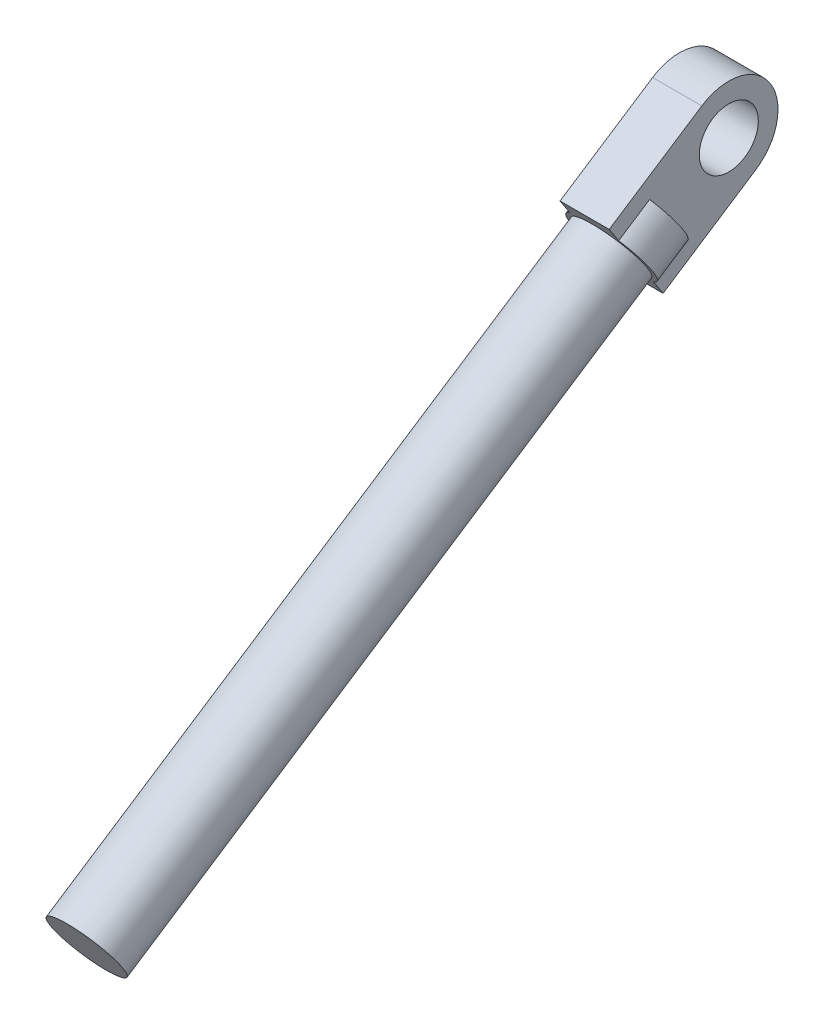
ISO-10303-21;
HEADER;
FILE_DESCRIPTION(('STEP AP214'),'2;1');
FILE_NAME('part.step','',(''),(''),'','','');
FILE_SCHEMA(('AUTOMOTIVE_DESIGN { 1 0 10303 214 1 1 1 1 }'));
ENDSEC;
DATA;
#1=APPLICATION_CONTEXT('core data for automotive mechanical design processes');
#2=APPLICATION_PROTOCOL_DEFINITION('international standard','automotive_design',2000,#1);
#3=PRODUCT_CONTEXT('',#1,'mechanical');
#4=PRODUCT('Part','Part','',(#3));
#5=PRODUCT_RELATED_PRODUCT_CATEGORY('part','',(#4));
#6=PRODUCT_DEFINITION_FORMATION('','',#4);
#7=PRODUCT_DEFINITION_CONTEXT('part definition',#1,'design');
#8=PRODUCT_DEFINITION('design','',#6,#7);
#9=PRODUCT_DEFINITION_SHAPE('','',#8);
#10=(LENGTH_UNIT() NAMED_UNIT(*) SI_UNIT(.MILLI.,.METRE.));
#11=(NAMED_UNIT(*) PLANE_ANGLE_UNIT() SI_UNIT($,.RADIAN.));
#12=(NAMED_UNIT(*) SI_UNIT($,.STERADIAN.) SOLID_ANGLE_UNIT());
#13=UNCERTAINTY_MEASURE_WITH_UNIT(LENGTH_MEASURE(1.E-05),#10,'distance_accuracy_value','');
#14=(GEOMETRIC_REPRESENTATION_CONTEXT(3) GLOBAL_UNCERTAINTY_ASSIGNED_CONTEXT((#13)) GLOBAL_UNIT_ASSIGNED_CONTEXT((#10,
#11,#12)) REPRESENTATION_CONTEXT('',''));
#15=CARTESIAN_POINT('',(0.,0.,0.));
#16=DIRECTION('',(0.,0.,1.));
#17=DIRECTION('',(1.,0.,0.));
#18=AXIS2_PLACEMENT_3D('',#15,#16,#17);
#19=CARTESIAN_POINT('',(2000.00000004822,5467.96135295154,-4305.75126019251));
#20=DIRECTION('',(0.,-0.547699180385105,0.836675329984985));
#21=DIRECTION('',(-1.,0.,0.));
#22=AXIS2_PLACEMENT_3D('',#19,#20,#21);
#23=PLANE('',#22);
#24=DIRECTION('',(0.,-0.836675329984985,-0.547699180385105));
#25=VECTOR('',#24,1.);
#26=CARTESIAN_POINT('',(2050.00000004817,5467.96135295154,-4305.75126019251));
#27=LINE('',#26,#25);
#28=CARTESIAN_POINT('',(2050.00000004817,5413.79157733861,-4341.21154047277));
#29=VERTEX_POINT('',#28);
#30=CARTESIAN_POINT('',(2050.00000004817,5522.13112856446,-4270.29097991226));
#31=VERTEX_POINT('',#30);
#32=EDGE_CURVE('E74',#29,#31,#27,.F.);
#33=ORIENTED_EDGE('',*,*,#32,.T.);
#34=CARTESIAN_POINT('',(2000.00000004822,5467.96135295154,-4305.75126019251));
#35=DIRECTION('',(0.,-0.547699180385105,0.836675329984985));
#36=DIRECTION('',(-1.,0.,0.));
#37=AXIS2_PLACEMENT_3D('',#34,#35,#36);
#38=CIRCLE('',#37,81.8033988750113);
#39=EDGE_CURVE('E19',#29,#31,#38,.T.);
#40=ORIENTED_EDGE('',*,*,#39,.F.);
#41=EDGE_LOOP('',(#33,#40));
#42=FACE_BOUND('',#41,.T.);
#43=ADVANCED_FACE('F16',(#42),#23,.F.);
#44=CARTESIAN_POINT('',(1950.00000004817,5550.11623000931,-4431.25255969027));
#45=DIRECTION('',(-1.,0.,0.));
#46=DIRECTION('',(0.,0.547699180385105,-0.836675329984985));
#47=AXIS2_PLACEMENT_3D('',#44,#45,#46);
#48=CYLINDRICAL_SURFACE('',#47,60.0000000000005);
#49=CARTESIAN_POINT('',(1950.00000004817,5550.11623000931,-4431.25255969027));
#50=DIRECTION('',(-1.,0.,0.));
#51=DIRECTION('',(0.,0.547699180385105,-0.836675329984985));
#52=AXIS2_PLACEMENT_3D('',#49,#50,#51);
#53=CIRCLE('',#52,60.0000000000005);
#54=CARTESIAN_POINT('',(1950.00000004817,5582.97818083242,-4481.45307948937));
#55=VERTEX_POINT('',#54);
#56=EDGE_CURVE('E118',#55,#55,#53,.F.);
#57=ORIENTED_EDGE('',*,*,#56,.F.);
#58=EDGE_LOOP('',(#57));
#59=FACE_BOUND('',#58,.T.);
#60=CARTESIAN_POINT('',(2050.00000004817,5550.11623000931,-4431.25255969027));
#61=DIRECTION('',(-1.,0.,0.));
#62=DIRECTION('',(0.,0.547699180385105,-0.836675329984985));
#63=AXIS2_PLACEMENT_3D('',#60,#61,#62);
#64=CIRCLE('',#63,60.0000000000005);
#65=CARTESIAN_POINT('',(2050.00000004817,5582.97818083242,-4481.45307948937));
#66=VERTEX_POINT('',#65);
#67=EDGE_CURVE('E77',#66,#66,#64,.F.);
#68=ORIENTED_EDGE('',*,*,#67,.T.);
#69=EDGE_LOOP('',(#68));
#70=FACE_BOUND('',#69,.T.);
#71=ADVANCED_FACE('F201',(#59,#70),#48,.F.);
#72=CARTESIAN_POINT('',(2050.00000004817,5550.11623000931,-4431.25255969027));
#73=DIRECTION('',(-1.,0.,0.));
#74=DIRECTION('',(0.,0.547699180385105,-0.836675329984985));
#75=AXIS2_PLACEMENT_3D('',#72,#73,#74);
#76=CYLINDRICAL_SURFACE('',#75,99.9999999999996);
#77=DIRECTION('',(1.,0.,0.));
#78=VECTOR('',#77,1.);
#79=CARTESIAN_POINT('',(2050.00000004817,5466.44869701081,-4486.02247772878));
#80=LINE('',#79,#78);
#81=CARTESIAN_POINT('',(1950.00000004817,5466.44869701081,-4486.02247772878));
#82=VERTEX_POINT('',#81);
#83=CARTESIAN_POINT('',(2050.00000004817,5466.44869701081,-4486.02247772878));
#84=VERTEX_POINT('',#83);
#85=EDGE_CURVE('E78',#82,#84,#80,.T.);
#86=ORIENTED_EDGE('',*,*,#85,.F.);
#87=CARTESIAN_POINT('',(1950.00000004817,5550.11623000931,-4431.25255969027));
#88=DIRECTION('',(-1.,0.,0.));
#89=DIRECTION('',(0.,0.547699180385105,-0.836675329984985));
#90=AXIS2_PLACEMENT_3D('',#87,#88,#89);
#91=CIRCLE('',#90,99.9999999999996);
#92=CARTESIAN_POINT('',(1950.00000004817,5633.78376300781,-4376.48264165176));
#93=VERTEX_POINT('',#92);
#94=EDGE_CURVE('E113',#93,#82,#91,.T.);
#95=ORIENTED_EDGE('',*,*,#94,.F.);
#96=DIRECTION('',(1.,0.,0.));
#97=VECTOR('',#96,1.);
#98=CARTESIAN_POINT('',(2050.00000004817,5633.78376300781,-4376.48264165176));
#99=LINE('',#98,#97);
#100=CARTESIAN_POINT('',(2050.00000004817,5633.78376300781,-4376.48264165176));
#101=VERTEX_POINT('',#100);
#102=EDGE_CURVE('E96',#101,#93,#99,.F.);
#103=ORIENTED_EDGE('',*,*,#102,.F.);
#104=CARTESIAN_POINT('',(2050.00000004817,5550.11623000931,-4431.25255969027));
#105=DIRECTION('',(-1.,0.,0.));
#106=DIRECTION('',(0.,0.547699180385105,-0.836675329984985));
#107=AXIS2_PLACEMENT_3D('',#104,#105,#106);
#108=CIRCLE('',#107,99.9999999999996);
#109=EDGE_CURVE('E122',#101,#84,#108,.T.);
#110=ORIENTED_EDGE('',*,*,#109,.T.);
#111=EDGE_LOOP('',(#86,#95,#103,#110));
#112=FACE_BOUND('',#111,.T.);
#113=ADVANCED_FACE('F199',(#112),#76,.T.);
#114=CARTESIAN_POINT('',(2000.00000004822,5467.96135295154,-4305.75126019251));
#115=DIRECTION('',(0.,-0.547699180385105,0.836675329984985));
#116=DIRECTION('',(-1.,0.,0.));
#117=AXIS2_PLACEMENT_3D('',#114,#115,#116);
#118=PLANE('',#117);
#119=DIRECTION('',(0.,-0.836675329984985,-0.547699180385105));
#120=VECTOR('',#119,1.);
#121=CARTESIAN_POINT('',(1950.00000004817,5467.96135295154,-4305.75126019251));
#122=LINE('',#121,#120);
#123=CARTESIAN_POINT('',(1950.00000004817,5413.79157733867,-4341.21154047273));
#124=VERTEX_POINT('',#123);
#125=CARTESIAN_POINT('',(1950.00000004817,5522.1311285644,-4270.2909799123));
#126=VERTEX_POINT('',#125);
#127=EDGE_CURVE('E121',#124,#126,#122,.F.);
#128=ORIENTED_EDGE('',*,*,#127,.F.);
#129=CARTESIAN_POINT('',(2000.00000004822,5467.96135295154,-4305.75126019251));
#130=DIRECTION('',(0.,-0.547699180385105,0.836675329984985));
#131=DIRECTION('',(-1.,0.,0.));
#132=AXIS2_PLACEMENT_3D('',#129,#130,#131);
#133=CIRCLE('',#132,81.8033988750117);
#134=EDGE_CURVE('E108',#126,#124,#133,.T.);
#135=ORIENTED_EDGE('',*,*,#134,.F.);
#136=EDGE_LOOP('',(#128,#135));
#137=FACE_BOUND('',#136,.T.);
#138=ADVANCED_FACE('F191',(#137),#118,.F.);
#139=CARTESIAN_POINT('',(2050.00000004817,5466.44869701081,-4486.02247772878));
#140=DIRECTION('',(0.,-0.836675329984985,-0.547699180385105));
#141=DIRECTION('',(0.,0.547699180385105,-0.836675329984985));
#142=AXIS2_PLACEMENT_3D('',#139,#140,#141);
#143=PLANE('',#142);
#144=DIRECTION('',(0.,0.547699180385105,-0.836675329984985));
#145=VECTOR('',#144,1.);
#146=CARTESIAN_POINT('',(2050.00000004817,5466.44869701081,-4486.02247772878));
#147=LINE('',#146,#145);
#148=CARTESIAN_POINT('',(2050.00000004817,5343.21638142416,-4297.77052848215));
#149=VERTEX_POINT('',#148);
#150=EDGE_CURVE('E87',#84,#149,#147,.F.);
#151=ORIENTED_EDGE('',*,*,#150,.T.);
#152=DIRECTION('',(-1.,0.,0.));
#153=VECTOR('',#152,1.);
#154=CARTESIAN_POINT('',(2050.00000004817,5343.21638142416,-4297.77052848215));
#155=LINE('',#154,#153);
#156=CARTESIAN_POINT('',(1950.00000004817,5343.21638142416,-4297.77052848215));
#157=VERTEX_POINT('',#156);
#158=EDGE_CURVE('E131',#157,#149,#155,.F.);
#159=ORIENTED_EDGE('',*,*,#158,.F.);
#160=DIRECTION('',(0.,0.547699180385105,-0.836675329984985));
#161=VECTOR('',#160,1.);
#162=CARTESIAN_POINT('',(1950.00000004817,5466.44869701081,-4486.02247772878));
#163=LINE('',#162,#161);
#164=EDGE_CURVE('E116',#82,#157,#163,.F.);
#165=ORIENTED_EDGE('',*,*,#164,.F.);
#166=ORIENTED_EDGE('',*,*,#85,.T.);
#167=EDGE_LOOP('',(#151,#159,#165,#166));
#168=FACE_BOUND('',#167,.T.);
#169=ADVANCED_FACE('F143',(#168),#143,.T.);
#170=CARTESIAN_POINT('',(2000.00000004822,5467.96135295154,-4305.75126019251));
#171=DIRECTION('',(0.,-0.547699180385105,0.836675329984985));
#172=DIRECTION('',(-1.,0.,0.));
#173=AXIS2_PLACEMENT_3D('',#170,#171,#172);
#174=CYLINDRICAL_SURFACE('',#173,81.8033988750113);
#175=ORIENTED_EDGE('',*,*,#39,.T.);
#176=DIRECTION('',(0.,0.547699180385105,-0.836675329984985));
#177=VECTOR('',#176,1.);
#178=CARTESIAN_POINT('',(2050.00000004817,5604.28600562223,-4395.79227941001));
#179=LINE('',#178,#177);
#180=CARTESIAN_POINT('',(2050.00000004817,5481.05369003558,-4207.54033016338));
#181=VERTEX_POINT('',#180);
#182=EDGE_CURVE('E92',#31,#181,#179,.F.);
#183=ORIENTED_EDGE('',*,*,#182,.T.);
#184=CARTESIAN_POINT('',(2000.00000004822,5426.88391442265,-4243.00061044364));
#185=DIRECTION('',(0.,-0.547699180385105,0.836675329984985));
#186=DIRECTION('',(-1.,0.,0.));
#187=AXIS2_PLACEMENT_3D('',#184,#185,#186);
#188=CIRCLE('',#187,81.8033988750113);
#189=CARTESIAN_POINT('',(2050.00000004817,5372.71413880973,-4278.4608907239));
#190=VERTEX_POINT('',#189);
#191=EDGE_CURVE('E83',#190,#181,#188,.T.);
#192=ORIENTED_EDGE('',*,*,#191,.F.);
#193=DIRECTION('',(0.,0.547699180385105,-0.836675329984985));
#194=VECTOR('',#193,1.);
#195=CARTESIAN_POINT('',(2050.00000004817,5495.94645439638,-4466.71283997053));
#196=LINE('',#195,#194);
#197=EDGE_CURVE('E80',#190,#29,#196,.T.);
#198=ORIENTED_EDGE('',*,*,#197,.T.);
#199=EDGE_LOOP('',(#175,#183,#192,#198));
#200=FACE_BOUND('',#199,.T.);
#201=ADVANCED_FACE('F81',(#200),#174,.T.);
#202=CARTESIAN_POINT('',(2050.00000004817,5550.11623000931,-4431.25255969027));
#203=DIRECTION('',(-1.,0.,0.));
#204=DIRECTION('',(0.,0.547699180385105,-0.836675329984985));
#205=AXIS2_PLACEMENT_3D('',#202,#203,#204);
#206=PLANE('',#205);
#207=ORIENTED_EDGE('',*,*,#197,.F.);
#208=DIRECTION('',(0.,-0.836675329984985,-0.547699180385105));
#209=VECTOR('',#208,1.);
#210=CARTESIAN_POINT('',(2050.00000004817,5343.21638142416,-4297.77052848215));
#211=LINE('',#210,#209);
#212=EDGE_CURVE('E107',#149,#190,#211,.F.);
#213=ORIENTED_EDGE('',*,*,#212,.F.);
#214=ORIENTED_EDGE('',*,*,#150,.F.);
#215=ORIENTED_EDGE('',*,*,#109,.F.);
#216=DIRECTION('',(0.,-0.547699180385105,0.836675329984985));
#217=VECTOR('',#216,1.);
#218=CARTESIAN_POINT('',(2050.00000004817,5510.55144742115,-4188.23069240513));
#219=LINE('',#218,#217);
#220=CARTESIAN_POINT('',(2050.00000004817,5510.55144742115,-4188.23069240513));
#221=VERTEX_POINT('',#220);
#222=EDGE_CURVE('E93',#221,#101,#219,.F.);
#223=ORIENTED_EDGE('',*,*,#222,.F.);
#224=DIRECTION('',(0.,-0.836675329984985,-0.547699180385105));
#225=VECTOR('',#224,1.);
#226=CARTESIAN_POINT('',(2050.00000004817,5343.21638142416,-4297.77052848215));
#227=LINE('',#226,#225);
#228=EDGE_CURVE('E106',#181,#221,#227,.F.);
#229=ORIENTED_EDGE('',*,*,#228,.F.);
#230=ORIENTED_EDGE('',*,*,#182,.F.);
#231=ORIENTED_EDGE('',*,*,#32,.F.);
#232=EDGE_LOOP('',(#207,#213,#214,#215,#223,#229,#230,#231));
#233=FACE_BOUND('',#232,.T.);
#234=ORIENTED_EDGE('',*,*,#67,.F.);
#235=EDGE_LOOP('',(#234));
#236=FACE_BOUND('',#235,.T.);
#237=ADVANCED_FACE('F89',(#233,#236),#206,.F.);
#238=CARTESIAN_POINT('',(2050.00000004817,5510.55144742115,-4188.23069240513));
#239=DIRECTION('',(0.,0.836675329984985,0.547699180385105));
#240=DIRECTION('',(0.,-0.547699180385105,0.836675329984985));
#241=AXIS2_PLACEMENT_3D('',#238,#239,#240);
#242=PLANE('',#241);
#243=ORIENTED_EDGE('',*,*,#222,.T.);
#244=ORIENTED_EDGE('',*,*,#102,.T.);
#245=DIRECTION('',(0.,0.547699180385105,-0.836675329984985));
#246=VECTOR('',#245,1.);
#247=CARTESIAN_POINT('',(1950.00000004817,5633.78376300781,-4376.48264165176));
#248=LINE('',#247,#246);
#249=CARTESIAN_POINT('',(1950.00000004817,5510.55144742115,-4188.23069240513));
#250=VERTEX_POINT('',#249);
#251=EDGE_CURVE('E117',#250,#93,#248,.T.);
#252=ORIENTED_EDGE('',*,*,#251,.F.);
#253=DIRECTION('',(-1.,0.,0.));
#254=VECTOR('',#253,1.);
#255=CARTESIAN_POINT('',(2050.00000004817,5510.55144742115,-4188.23069240513));
#256=LINE('',#255,#254);
#257=EDGE_CURVE('E154',#221,#250,#256,.T.);
#258=ORIENTED_EDGE('',*,*,#257,.F.);
#259=EDGE_LOOP('',(#243,#244,#252,#258));
#260=FACE_BOUND('',#259,.T.);
#261=ADVANCED_FACE('F198',(#260),#242,.T.);
#262=CARTESIAN_POINT('',(1950.00000004817,5550.11623000931,-4431.25255969027));
#263=DIRECTION('',(-1.,0.,0.));
#264=DIRECTION('',(0.,0.547699180385105,-0.836675329984985));
#265=AXIS2_PLACEMENT_3D('',#262,#263,#264);
#266=PLANE('',#265);
#267=ORIENTED_EDGE('',*,*,#164,.T.);
#268=DIRECTION('',(0.,-0.836675329984985,-0.547699180385105));
#269=VECTOR('',#268,1.);
#270=CARTESIAN_POINT('',(1950.00000004817,5343.21638142416,-4297.77052848215));
#271=LINE('',#270,#269);
#272=CARTESIAN_POINT('',(1950.00000004817,5372.71413880979,-4278.46089072385));
#273=VERTEX_POINT('',#272);
#274=EDGE_CURVE('E134',#273,#157,#271,.T.);
#275=ORIENTED_EDGE('',*,*,#274,.F.);
#276=DIRECTION('',(0.,-0.547699180385105,0.836675329984985));
#277=VECTOR('',#276,1.);
#278=CARTESIAN_POINT('',(1950.00000004817,5413.79157733868,-4341.21154047273));
#279=LINE('',#278,#277);
#280=EDGE_CURVE('E111',#124,#273,#279,.T.);
#281=ORIENTED_EDGE('',*,*,#280,.F.);
#282=ORIENTED_EDGE('',*,*,#127,.T.);
#283=DIRECTION('',(0.,-0.547699180385105,0.836675329984985));
#284=VECTOR('',#283,1.);
#285=CARTESIAN_POINT('',(1950.00000004817,5522.1311285644,-4270.2909799123));
#286=LINE('',#285,#284);
#287=CARTESIAN_POINT('',(1950.00000004817,5481.05369003552,-4207.54033016342));
#288=VERTEX_POINT('',#287);
#289=EDGE_CURVE('E112',#288,#126,#286,.F.);
#290=ORIENTED_EDGE('',*,*,#289,.F.);
#291=DIRECTION('',(0.,-0.836675329984985,-0.547699180385105));
#292=VECTOR('',#291,1.);
#293=CARTESIAN_POINT('',(1950.00000004817,5343.21638142416,-4297.77052848215));
#294=LINE('',#293,#292);
#295=EDGE_CURVE('E104',#250,#288,#294,.T.);
#296=ORIENTED_EDGE('',*,*,#295,.F.);
#297=ORIENTED_EDGE('',*,*,#251,.T.);
#298=ORIENTED_EDGE('',*,*,#94,.T.);
#299=EDGE_LOOP('',(#267,#275,#281,#282,#290,#296,#297,#298));
#300=FACE_BOUND('',#299,.T.);
#301=ORIENTED_EDGE('',*,*,#56,.T.);
#302=EDGE_LOOP('',(#301));
#303=FACE_BOUND('',#302,.T.);
#304=ADVANCED_FACE('F186',(#300,#303),#266,.T.);
#305=CARTESIAN_POINT('',(2000.00000004822,5467.96135295154,-4305.75126019251));
#306=DIRECTION('',(0.,-0.547699180385105,0.836675329984985));
#307=DIRECTION('',(-1.,0.,0.));
#308=AXIS2_PLACEMENT_3D('',#305,#306,#307);
#309=CYLINDRICAL_SURFACE('',#308,81.8033988750117);
#310=ORIENTED_EDGE('',*,*,#280,.T.);
#311=CARTESIAN_POINT('',(2000.00000004822,5426.88391442265,-4243.00061044364));
#312=DIRECTION('',(0.,-0.547699180385105,0.836675329984985));
#313=DIRECTION('',(-1.,0.,0.));
#314=AXIS2_PLACEMENT_3D('',#311,#312,#313);
#315=CIRCLE('',#314,81.8033988750117);
#316=EDGE_CURVE('E34',#288,#273,#315,.T.);
#317=ORIENTED_EDGE('',*,*,#316,.F.);
#318=ORIENTED_EDGE('',*,*,#289,.T.);
#319=ORIENTED_EDGE('',*,*,#134,.T.);
#320=EDGE_LOOP('',(#310,#317,#318,#319));
#321=FACE_BOUND('',#320,.T.);
#322=ADVANCED_FACE('F189',(#321),#309,.T.);
#323=CARTESIAN_POINT('',(2072.50000004822,4728.56745943164,-3176.23956471278));
#324=DIRECTION('',(0.,-0.547699180385105,0.836675329984985));
#325=DIRECTION('',(-1.,0.,0.));
#326=AXIS2_PLACEMENT_3D('',#323,#324,#325);
#327=PLANE('',#326);
#328=CARTESIAN_POINT('',(2000.00000004822,4728.56745943164,-3176.23956471278));
#329=DIRECTION('',(0.,0.547699180385105,-0.836675329984985));
#330=DIRECTION('',(1.,0.,0.));
#331=AXIS2_PLACEMENT_3D('',#328,#329,#330);
#332=CIRCLE('',#331,72.5);
#333=CARTESIAN_POINT('',(2072.50000004822,4728.56745943164,-3176.23956471278));
#334=VERTEX_POINT('',#333);
#335=EDGE_CURVE('E25',#334,#334,#332,.T.);
#336=ORIENTED_EDGE('',*,*,#335,.F.);
#337=EDGE_LOOP('',(#336));
#338=FACE_BOUND('',#337,.T.);
#339=ADVANCED_FACE('F217',(#338),#327,.T.);
#340=CARTESIAN_POINT('',(2050.00000004817,5343.21638142416,-4297.77052848215));
#341=DIRECTION('',(0.,-0.547699180385105,0.836675329984985));
#342=DIRECTION('',(-1.,0.,0.));
#343=AXIS2_PLACEMENT_3D('',#340,#341,#342);
#344=PLANE('',#343);
#345=ORIENTED_EDGE('',*,*,#295,.T.);
#346=ORIENTED_EDGE('',*,*,#316,.T.);
#347=ORIENTED_EDGE('',*,*,#274,.T.);
#348=ORIENTED_EDGE('',*,*,#158,.T.);
#349=ORIENTED_EDGE('',*,*,#212,.T.);
#350=ORIENTED_EDGE('',*,*,#191,.T.);
#351=ORIENTED_EDGE('',*,*,#228,.T.);
#352=ORIENTED_EDGE('',*,*,#257,.T.);
#353=EDGE_LOOP('',(#345,#346,#347,#348,#349,#350,#351,#352));
#354=FACE_BOUND('',#353,.T.);
#355=CARTESIAN_POINT('',(2000.00000004822,5426.88391442265,-4243.00061044364));
#356=DIRECTION('',(0.,0.547699180385105,-0.836675329984985));
#357=DIRECTION('',(1.,0.,0.));
#358=AXIS2_PLACEMENT_3D('',#355,#356,#357);
#359=CIRCLE('',#358,72.5);
#360=CARTESIAN_POINT('',(2072.50000004822,5426.88391442265,-4243.00061044364));
#361=VERTEX_POINT('',#360);
#362=EDGE_CURVE('E10',#361,#361,#359,.F.);
#363=ORIENTED_EDGE('',*,*,#362,.F.);
#364=EDGE_LOOP('',(#363));
#365=FACE_BOUND('',#364,.T.);
#366=ADVANCED_FACE('F182',(#354,#365),#344,.T.);
#367=CARTESIAN_POINT('',(2000.00000004822,4728.56745943164,-3176.23956471278));
#368=DIRECTION('',(0.,0.547699180385105,-0.836675329984985));
#369=DIRECTION('',(1.,0.,0.));
#370=AXIS2_PLACEMENT_3D('',#367,#368,#369);
#371=CYLINDRICAL_SURFACE('',#370,72.5);
#372=ORIENTED_EDGE('',*,*,#362,.T.);
#373=EDGE_LOOP('',(#372));
#374=FACE_BOUND('',#373,.T.);
#375=ORIENTED_EDGE('',*,*,#335,.T.);
#376=EDGE_LOOP('',(#375));
#377=FACE_BOUND('',#376,.T.);
#378=ADVANCED_FACE('F210',(#374,#377),#371,.T.);
#379=CLOSED_SHELL('',(#43,#71,#113,#138,#169,#201,#237,#261,#304,#322,#339,#366,#378));
#380=MANIFOLD_SOLID_BREP('B1',#379);
#381=ADVANCED_BREP_SHAPE_REPRESENTATION('',(#18,#380),#14);
#382=SHAPE_DEFINITION_REPRESENTATION(#9,#381);
ENDSEC;
END-ISO-10303-21;
